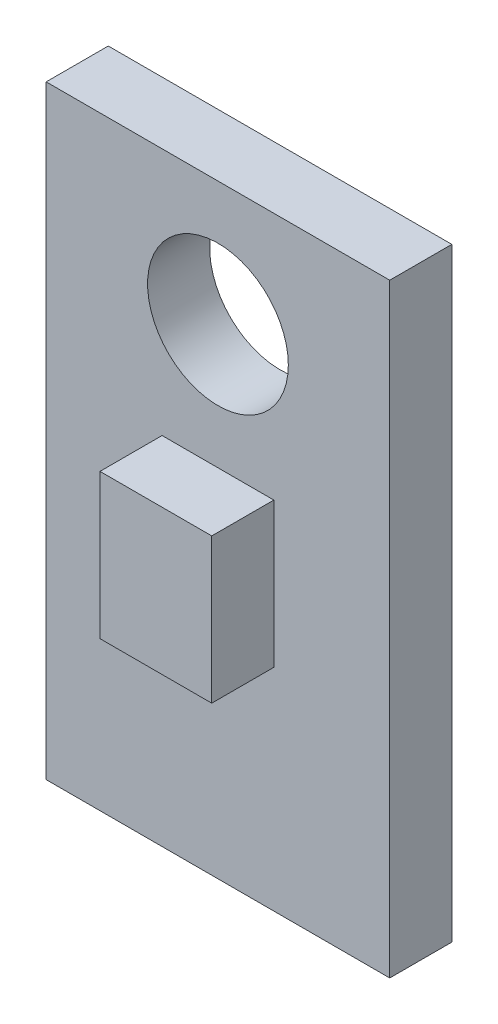
ISO-10303-21;
HEADER;
FILE_DESCRIPTION(('STEP AP214'),'2;1');
FILE_NAME('part.step','',(''),(''),'','','');
FILE_SCHEMA(('AUTOMOTIVE_DESIGN { 1 0 10303 214 1 1 1 1 }'));
ENDSEC;
DATA;
#1=APPLICATION_CONTEXT('core data for automotive mechanical design processes');
#2=APPLICATION_PROTOCOL_DEFINITION('international standard','automotive_design',2000,#1);
#3=PRODUCT_CONTEXT('',#1,'mechanical');
#4=PRODUCT('Part','Part','',(#3));
#5=PRODUCT_RELATED_PRODUCT_CATEGORY('part','',(#4));
#6=PRODUCT_DEFINITION_FORMATION('','',#4);
#7=PRODUCT_DEFINITION_CONTEXT('part definition',#1,'design');
#8=PRODUCT_DEFINITION('design','',#6,#7);
#9=PRODUCT_DEFINITION_SHAPE('','',#8);
#10=(LENGTH_UNIT() NAMED_UNIT(*) SI_UNIT(.MILLI.,.METRE.));
#11=(NAMED_UNIT(*) PLANE_ANGLE_UNIT() SI_UNIT($,.RADIAN.));
#12=(NAMED_UNIT(*) SI_UNIT($,.STERADIAN.) SOLID_ANGLE_UNIT());
#13=UNCERTAINTY_MEASURE_WITH_UNIT(LENGTH_MEASURE(1.E-05),#10,'distance_accuracy_value','');
#14=(GEOMETRIC_REPRESENTATION_CONTEXT(3) GLOBAL_UNCERTAINTY_ASSIGNED_CONTEXT((#13)) GLOBAL_UNIT_ASSIGNED_CONTEXT((#10,
#11,#12)) REPRESENTATION_CONTEXT('',''));
#15=CARTESIAN_POINT('',(0.,0.,0.));
#16=DIRECTION('',(0.,0.,1.));
#17=DIRECTION('',(1.,0.,0.));
#18=AXIS2_PLACEMENT_3D('',#15,#16,#17);
#19=CARTESIAN_POINT('',(0.,0.,1.5));
#20=DIRECTION('',(0.,0.,-1.));
#21=DIRECTION('',(-1.,0.,0.));
#22=AXIS2_PLACEMENT_3D('',#19,#20,#21);
#23=PLANE('',#22);
#24=DIRECTION('',(0.,-1.,0.));
#25=VECTOR('',#24,1.);
#26=CARTESIAN_POINT('',(0.,0.,1.5));
#27=LINE('',#26,#25);
#28=CARTESIAN_POINT('',(0.,14.6,1.5));
#29=VERTEX_POINT('',#28);
#30=CARTESIAN_POINT('',(0.,0.,1.5));
#31=VERTEX_POINT('',#30);
#32=EDGE_CURVE('E130',#29,#31,#27,.T.);
#33=ORIENTED_EDGE('',*,*,#32,.T.);
#34=DIRECTION('',(1.,0.,0.));
#35=VECTOR('',#34,1.);
#36=CARTESIAN_POINT('',(0.,0.,1.5));
#37=LINE('',#36,#35);
#38=CARTESIAN_POINT('',(8.3,0.,1.5));
#39=VERTEX_POINT('',#38);
#40=EDGE_CURVE('E133',#31,#39,#37,.T.);
#41=ORIENTED_EDGE('',*,*,#40,.T.);
#42=DIRECTION('',(0.,1.,0.));
#43=VECTOR('',#42,1.);
#44=CARTESIAN_POINT('',(8.3,0.,1.5));
#45=LINE('',#44,#43);
#46=CARTESIAN_POINT('',(8.3,14.6,1.5));
#47=VERTEX_POINT('',#46);
#48=EDGE_CURVE('E136',#39,#47,#45,.T.);
#49=ORIENTED_EDGE('',*,*,#48,.T.);
#50=DIRECTION('',(-1.,0.,0.));
#51=VECTOR('',#50,1.);
#52=CARTESIAN_POINT('',(0.,14.6,1.5));
#53=LINE('',#52,#51);
#54=EDGE_CURVE('E138',#47,#29,#53,.T.);
#55=ORIENTED_EDGE('',*,*,#54,.T.);
#56=EDGE_LOOP('',(#33,#41,#49,#55));
#57=FACE_BOUND('',#56,.T.);
#58=CARTESIAN_POINT('',(4.15,11.6,1.5));
#59=DIRECTION('',(0.,0.,1.));
#60=DIRECTION('',(1.,0.,0.));
#61=AXIS2_PLACEMENT_3D('',#58,#59,#60);
#62=CIRCLE('',#61,1.7);
#63=CARTESIAN_POINT('',(5.85,11.6,1.5));
#64=VERTEX_POINT('',#63);
#65=EDGE_CURVE('E118',#64,#64,#62,.T.);
#66=ORIENTED_EDGE('',*,*,#65,.F.);
#67=EDGE_LOOP('',(#66));
#68=FACE_BOUND('',#67,.T.);
#69=DIRECTION('',(0.,-1.,0.));
#70=VECTOR('',#69,1.);
#71=CARTESIAN_POINT('',(2.8,8.6,1.5));
#72=LINE('',#71,#70);
#73=CARTESIAN_POINT('',(2.8,8.6,1.5));
#74=VERTEX_POINT('',#73);
#75=CARTESIAN_POINT('',(2.8,5.1,1.5));
#76=VERTEX_POINT('',#75);
#77=EDGE_CURVE('E117',#74,#76,#72,.T.);
#78=ORIENTED_EDGE('',*,*,#77,.F.);
#79=DIRECTION('',(-1.,0.,0.));
#80=VECTOR('',#79,1.);
#81=CARTESIAN_POINT('',(2.8,8.6,1.5));
#82=LINE('',#81,#80);
#83=CARTESIAN_POINT('',(5.5,8.6,1.5));
#84=VERTEX_POINT('',#83);
#85=EDGE_CURVE('E114',#84,#74,#82,.T.);
#86=ORIENTED_EDGE('',*,*,#85,.F.);
#87=DIRECTION('',(0.,1.,0.));
#88=VECTOR('',#87,1.);
#89=CARTESIAN_POINT('',(5.5,8.6,1.5));
#90=LINE('',#89,#88);
#91=CARTESIAN_POINT('',(5.5,5.1,1.5));
#92=VERTEX_POINT('',#91);
#93=EDGE_CURVE('E52',#92,#84,#90,.T.);
#94=ORIENTED_EDGE('',*,*,#93,.F.);
#95=DIRECTION('',(1.,0.,0.));
#96=VECTOR('',#95,1.);
#97=CARTESIAN_POINT('',(2.8,5.1,1.5));
#98=LINE('',#97,#96);
#99=EDGE_CURVE('E47',#76,#92,#98,.T.);
#100=ORIENTED_EDGE('',*,*,#99,.F.);
#101=EDGE_LOOP('',(#78,#86,#94,#100));
#102=FACE_BOUND('',#101,.T.);
#103=ADVANCED_FACE('F32',(#57,#68,#102),#23,.F.);
#104=CARTESIAN_POINT('',(0.,0.,1.5));
#105=DIRECTION('',(1.,0.,0.));
#106=DIRECTION('',(0.,0.,-1.));
#107=AXIS2_PLACEMENT_3D('',#104,#105,#106);
#108=PLANE('',#107);
#109=DIRECTION('',(0.,-1.,0.));
#110=VECTOR('',#109,1.);
#111=CARTESIAN_POINT('',(0.,0.,0.));
#112=LINE('',#111,#110);
#113=CARTESIAN_POINT('',(0.,14.6,0.));
#114=VERTEX_POINT('',#113);
#115=CARTESIAN_POINT('',(0.,0.,0.));
#116=VERTEX_POINT('',#115);
#117=EDGE_CURVE('E128',#114,#116,#112,.T.);
#118=ORIENTED_EDGE('',*,*,#117,.T.);
#119=DIRECTION('',(0.,0.,-1.));
#120=VECTOR('',#119,1.);
#121=CARTESIAN_POINT('',(0.,0.,1.5));
#122=LINE('',#121,#120);
#123=EDGE_CURVE('E11',#31,#116,#122,.T.);
#124=ORIENTED_EDGE('',*,*,#123,.F.);
#125=ORIENTED_EDGE('',*,*,#32,.F.);
#126=DIRECTION('',(0.,0.,-1.));
#127=VECTOR('',#126,1.);
#128=CARTESIAN_POINT('',(0.,14.6,1.5));
#129=LINE('',#128,#127);
#130=EDGE_CURVE('E140',#29,#114,#129,.T.);
#131=ORIENTED_EDGE('',*,*,#130,.T.);
#132=EDGE_LOOP('',(#118,#124,#125,#131));
#133=FACE_BOUND('',#132,.T.);
#134=ADVANCED_FACE('F34',(#133),#108,.F.);
#135=CARTESIAN_POINT('',(0.,0.,1.5));
#136=DIRECTION('',(0.,1.,0.));
#137=DIRECTION('',(0.,0.,1.));
#138=AXIS2_PLACEMENT_3D('',#135,#136,#137);
#139=PLANE('',#138);
#140=DIRECTION('',(1.,0.,0.));
#141=VECTOR('',#140,1.);
#142=CARTESIAN_POINT('',(0.,0.,0.));
#143=LINE('',#142,#141);
#144=CARTESIAN_POINT('',(8.3,0.,0.));
#145=VERTEX_POINT('',#144);
#146=EDGE_CURVE('E143',#116,#145,#143,.T.);
#147=ORIENTED_EDGE('',*,*,#146,.T.);
#148=DIRECTION('',(0.,0.,-1.));
#149=VECTOR('',#148,1.);
#150=CARTESIAN_POINT('',(8.3,0.,1.5));
#151=LINE('',#150,#149);
#152=EDGE_CURVE('E40',#39,#145,#151,.T.);
#153=ORIENTED_EDGE('',*,*,#152,.F.);
#154=ORIENTED_EDGE('',*,*,#40,.F.);
#155=ORIENTED_EDGE('',*,*,#123,.T.);
#156=EDGE_LOOP('',(#147,#153,#154,#155));
#157=FACE_BOUND('',#156,.T.);
#158=ADVANCED_FACE('F173',(#157),#139,.F.);
#159=CARTESIAN_POINT('',(8.3,0.,1.5));
#160=DIRECTION('',(-1.,0.,0.));
#161=DIRECTION('',(0.,0.,1.));
#162=AXIS2_PLACEMENT_3D('',#159,#160,#161);
#163=PLANE('',#162);
#164=DIRECTION('',(0.,1.,0.));
#165=VECTOR('',#164,1.);
#166=CARTESIAN_POINT('',(8.3,0.,0.));
#167=LINE('',#166,#165);
#168=CARTESIAN_POINT('',(8.3,14.6,0.));
#169=VERTEX_POINT('',#168);
#170=EDGE_CURVE('E145',#145,#169,#167,.T.);
#171=ORIENTED_EDGE('',*,*,#170,.T.);
#172=DIRECTION('',(0.,0.,-1.));
#173=VECTOR('',#172,1.);
#174=CARTESIAN_POINT('',(8.3,14.6,1.5));
#175=LINE('',#174,#173);
#176=EDGE_CURVE('E150',#47,#169,#175,.T.);
#177=ORIENTED_EDGE('',*,*,#176,.F.);
#178=ORIENTED_EDGE('',*,*,#48,.F.);
#179=ORIENTED_EDGE('',*,*,#152,.T.);
#180=EDGE_LOOP('',(#171,#177,#178,#179));
#181=FACE_BOUND('',#180,.T.);
#182=ADVANCED_FACE('F157',(#181),#163,.F.);
#183=CARTESIAN_POINT('',(0.,14.6,1.5));
#184=DIRECTION('',(0.,-1.,0.));
#185=DIRECTION('',(0.,0.,-1.));
#186=AXIS2_PLACEMENT_3D('',#183,#184,#185);
#187=PLANE('',#186);
#188=DIRECTION('',(-1.,0.,0.));
#189=VECTOR('',#188,1.);
#190=CARTESIAN_POINT('',(0.,14.6,0.));
#191=LINE('',#190,#189);
#192=EDGE_CURVE('E134',#169,#114,#191,.T.);
#193=ORIENTED_EDGE('',*,*,#192,.T.);
#194=ORIENTED_EDGE('',*,*,#130,.F.);
#195=ORIENTED_EDGE('',*,*,#54,.F.);
#196=ORIENTED_EDGE('',*,*,#176,.T.);
#197=EDGE_LOOP('',(#193,#194,#195,#196));
#198=FACE_BOUND('',#197,.T.);
#199=ADVANCED_FACE('F166',(#198),#187,.F.);
#200=CARTESIAN_POINT('',(0.,0.,0.));
#201=DIRECTION('',(0.,0.,-1.));
#202=DIRECTION('',(-1.,0.,0.));
#203=AXIS2_PLACEMENT_3D('',#200,#201,#202);
#204=PLANE('',#203);
#205=CARTESIAN_POINT('',(4.15,11.6,0.));
#206=DIRECTION('',(0.,0.,1.));
#207=DIRECTION('',(1.,0.,0.));
#208=AXIS2_PLACEMENT_3D('',#205,#206,#207);
#209=CIRCLE('',#208,1.7);
#210=CARTESIAN_POINT('',(5.85,11.6,0.));
#211=VERTEX_POINT('',#210);
#212=EDGE_CURVE('E121',#211,#211,#209,.T.);
#213=ORIENTED_EDGE('',*,*,#212,.T.);
#214=EDGE_LOOP('',(#213));
#215=FACE_BOUND('',#214,.T.);
#216=ORIENTED_EDGE('',*,*,#117,.F.);
#217=ORIENTED_EDGE('',*,*,#192,.F.);
#218=ORIENTED_EDGE('',*,*,#170,.F.);
#219=ORIENTED_EDGE('',*,*,#146,.F.);
#220=EDGE_LOOP('',(#216,#217,#218,#219));
#221=FACE_BOUND('',#220,.T.);
#222=ADVANCED_FACE('F163',(#215,#221),#204,.T.);
#223=CARTESIAN_POINT('',(4.15,11.6,0.));
#224=DIRECTION('',(0.,0.,1.));
#225=DIRECTION('',(1.,0.,0.));
#226=AXIS2_PLACEMENT_3D('',#223,#224,#225);
#227=CYLINDRICAL_SURFACE('',#226,1.7);
#228=ORIENTED_EDGE('',*,*,#212,.F.);
#229=EDGE_LOOP('',(#228));
#230=FACE_BOUND('',#229,.T.);
#231=ORIENTED_EDGE('',*,*,#65,.T.);
#232=EDGE_LOOP('',(#231));
#233=FACE_BOUND('',#232,.T.);
#234=ADVANCED_FACE('F186',(#230,#233),#227,.F.);
#235=CARTESIAN_POINT('',(2.8,8.6,3.));
#236=DIRECTION('',(1.,0.,0.));
#237=DIRECTION('',(0.,1.,0.));
#238=AXIS2_PLACEMENT_3D('',#235,#236,#237);
#239=PLANE('',#238);
#240=ORIENTED_EDGE('',*,*,#77,.T.);
#241=DIRECTION('',(0.,0.,-1.));
#242=VECTOR('',#241,1.);
#243=CARTESIAN_POINT('',(2.8,5.1,3.));
#244=LINE('',#243,#242);
#245=CARTESIAN_POINT('',(2.8,5.1,3.));
#246=VERTEX_POINT('',#245);
#247=EDGE_CURVE('E98',#246,#76,#244,.T.);
#248=ORIENTED_EDGE('',*,*,#247,.F.);
#249=DIRECTION('',(0.,-1.,0.));
#250=VECTOR('',#249,1.);
#251=CARTESIAN_POINT('',(2.8,8.6,3.));
#252=LINE('',#251,#250);
#253=CARTESIAN_POINT('',(2.8,8.6,3.));
#254=VERTEX_POINT('',#253);
#255=EDGE_CURVE('E105',#254,#246,#252,.T.);
#256=ORIENTED_EDGE('',*,*,#255,.F.);
#257=DIRECTION('',(0.,0.,-1.));
#258=VECTOR('',#257,1.);
#259=CARTESIAN_POINT('',(2.8,8.6,3.));
#260=LINE('',#259,#258);
#261=EDGE_CURVE('E277',#254,#74,#260,.T.);
#262=ORIENTED_EDGE('',*,*,#261,.T.);
#263=EDGE_LOOP('',(#240,#248,#256,#262));
#264=FACE_BOUND('',#263,.T.);
#265=ADVANCED_FACE('F116',(#264),#239,.F.);
#266=CARTESIAN_POINT('',(2.8,5.1,3.));
#267=DIRECTION('',(0.,1.,0.));
#268=DIRECTION('',(0.,0.,1.));
#269=AXIS2_PLACEMENT_3D('',#266,#267,#268);
#270=PLANE('',#269);
#271=ORIENTED_EDGE('',*,*,#99,.T.);
#272=DIRECTION('',(0.,0.,-1.));
#273=VECTOR('',#272,1.);
#274=CARTESIAN_POINT('',(5.5,5.1,3.));
#275=LINE('',#274,#273);
#276=CARTESIAN_POINT('',(5.5,5.1,3.));
#277=VERTEX_POINT('',#276);
#278=EDGE_CURVE('E101',#277,#92,#275,.T.);
#279=ORIENTED_EDGE('',*,*,#278,.F.);
#280=DIRECTION('',(1.,0.,0.));
#281=VECTOR('',#280,1.);
#282=CARTESIAN_POINT('',(2.8,5.1,3.));
#283=LINE('',#282,#281);
#284=EDGE_CURVE('E94',#246,#277,#283,.T.);
#285=ORIENTED_EDGE('',*,*,#284,.F.);
#286=ORIENTED_EDGE('',*,*,#247,.T.);
#287=EDGE_LOOP('',(#271,#279,#285,#286));
#288=FACE_BOUND('',#287,.T.);
#289=ADVANCED_FACE('F96',(#288),#270,.F.);
#290=CARTESIAN_POINT('',(5.5,8.6,3.));
#291=DIRECTION('',(-1.,0.,0.));
#292=DIRECTION('',(0.,0.,1.));
#293=AXIS2_PLACEMENT_3D('',#290,#291,#292);
#294=PLANE('',#293);
#295=ORIENTED_EDGE('',*,*,#93,.T.);
#296=DIRECTION('',(0.,0.,-1.));
#297=VECTOR('',#296,1.);
#298=CARTESIAN_POINT('',(5.5,8.6,3.));
#299=LINE('',#298,#297);
#300=CARTESIAN_POINT('',(5.5,8.6,3.));
#301=VERTEX_POINT('',#300);
#302=EDGE_CURVE('E123',#301,#84,#299,.T.);
#303=ORIENTED_EDGE('',*,*,#302,.F.);
#304=DIRECTION('',(0.,1.,0.));
#305=VECTOR('',#304,1.);
#306=CARTESIAN_POINT('',(5.5,8.6,3.));
#307=LINE('',#306,#305);
#308=EDGE_CURVE('E104',#277,#301,#307,.T.);
#309=ORIENTED_EDGE('',*,*,#308,.F.);
#310=ORIENTED_EDGE('',*,*,#278,.T.);
#311=EDGE_LOOP('',(#295,#303,#309,#310));
#312=FACE_BOUND('',#311,.T.);
#313=ADVANCED_FACE('F217',(#312),#294,.F.);
#314=CARTESIAN_POINT('',(2.8,8.6,3.));
#315=DIRECTION('',(0.,-1.,0.));
#316=DIRECTION('',(0.,0.,-1.));
#317=AXIS2_PLACEMENT_3D('',#314,#315,#316);
#318=PLANE('',#317);
#319=ORIENTED_EDGE('',*,*,#85,.T.);
#320=ORIENTED_EDGE('',*,*,#261,.F.);
#321=DIRECTION('',(-1.,0.,0.));
#322=VECTOR('',#321,1.);
#323=CARTESIAN_POINT('',(2.8,8.6,3.));
#324=LINE('',#323,#322);
#325=EDGE_CURVE('E110',#301,#254,#324,.T.);
#326=ORIENTED_EDGE('',*,*,#325,.F.);
#327=ORIENTED_EDGE('',*,*,#302,.T.);
#328=EDGE_LOOP('',(#319,#320,#326,#327));
#329=FACE_BOUND('',#328,.T.);
#330=ADVANCED_FACE('F224',(#329),#318,.F.);
#331=CARTESIAN_POINT('',(0.,0.,3.));
#332=DIRECTION('',(0.,0.,1.));
#333=DIRECTION('',(1.,0.,0.));
#334=AXIS2_PLACEMENT_3D('',#331,#332,#333);
#335=PLANE('',#334);
#336=ORIENTED_EDGE('',*,*,#255,.T.);
#337=ORIENTED_EDGE('',*,*,#284,.T.);
#338=ORIENTED_EDGE('',*,*,#308,.T.);
#339=ORIENTED_EDGE('',*,*,#325,.T.);
#340=EDGE_LOOP('',(#336,#337,#338,#339));
#341=FACE_BOUND('',#340,.T.);
#342=ADVANCED_FACE('F108',(#341),#335,.T.);
#343=CLOSED_SHELL('',(#103,#134,#158,#182,#199,#222,#234,#265,#289,#313,#330,#342));
#344=MANIFOLD_SOLID_BREP('B2',#343);
#345=ADVANCED_BREP_SHAPE_REPRESENTATION('',(#18,#344),#14);
#346=SHAPE_DEFINITION_REPRESENTATION(#9,#345);
ENDSEC;
END-ISO-10303-21;
